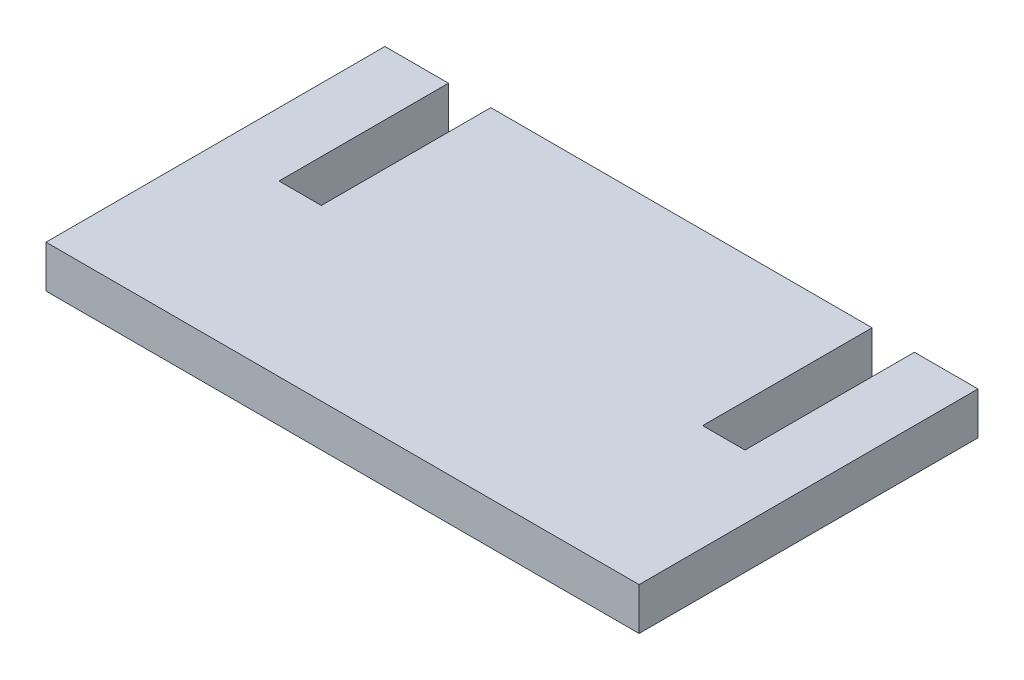
ISO-10303-21;
HEADER;
FILE_DESCRIPTION(('STEP AP214'),'2;1');
FILE_NAME('part.step','',(''),(''),'','','');
FILE_SCHEMA(('AUTOMOTIVE_DESIGN { 1 0 10303 214 1 1 1 1 }'));
ENDSEC;
DATA;
#1=APPLICATION_CONTEXT('core data for automotive mechanical design processes');
#2=APPLICATION_PROTOCOL_DEFINITION('international standard','automotive_design',2000,#1);
#3=PRODUCT_CONTEXT('',#1,'mechanical');
#4=PRODUCT('Part','Part','',(#3));
#5=PRODUCT_RELATED_PRODUCT_CATEGORY('part','',(#4));
#6=PRODUCT_DEFINITION_FORMATION('','',#4);
#7=PRODUCT_DEFINITION_CONTEXT('part definition',#1,'design');
#8=PRODUCT_DEFINITION('design','',#6,#7);
#9=PRODUCT_DEFINITION_SHAPE('','',#8);
#10=(LENGTH_UNIT() NAMED_UNIT(*) SI_UNIT(.MILLI.,.METRE.));
#11=(NAMED_UNIT(*) PLANE_ANGLE_UNIT() SI_UNIT($,.RADIAN.));
#12=(NAMED_UNIT(*) SI_UNIT($,.STERADIAN.) SOLID_ANGLE_UNIT());
#13=UNCERTAINTY_MEASURE_WITH_UNIT(LENGTH_MEASURE(1.E-05),#10,'distance_accuracy_value','');
#14=(GEOMETRIC_REPRESENTATION_CONTEXT(3) GLOBAL_UNCERTAINTY_ASSIGNED_CONTEXT((#13)) GLOBAL_UNIT_ASSIGNED_CONTEXT((#10,
#11,#12)) REPRESENTATION_CONTEXT('',''));
#15=CARTESIAN_POINT('',(0.,0.,0.));
#16=DIRECTION('',(0.,0.,1.));
#17=DIRECTION('',(1.,0.,0.));
#18=AXIS2_PLACEMENT_3D('',#15,#16,#17);
#19=CARTESIAN_POINT('',(0.,2.54,0.));
#20=DIRECTION('',(0.,0.,1.));
#21=DIRECTION('',(1.,0.,0.));
#22=AXIS2_PLACEMENT_3D('',#19,#20,#21);
#23=PLANE('',#22);
#24=DIRECTION('',(-1.,0.,0.));
#25=VECTOR('',#24,1.);
#26=CARTESIAN_POINT('',(0.,2.54,0.));
#27=LINE('',#26,#25);
#28=CARTESIAN_POINT('',(29.21,2.54,0.));
#29=VERTEX_POINT('',#28);
#30=CARTESIAN_POINT('',(6.35,2.54,0.));
#31=VERTEX_POINT('',#30);
#32=EDGE_CURVE('E196',#29,#31,#27,.T.);
#33=ORIENTED_EDGE('',*,*,#32,.F.);
#34=DIRECTION('',(0.,1.,0.));
#35=VECTOR('',#34,1.);
#36=CARTESIAN_POINT('',(29.21,0.,0.));
#37=LINE('',#36,#35);
#38=CARTESIAN_POINT('',(29.21,0.,0.));
#39=VERTEX_POINT('',#38);
#40=EDGE_CURVE('E151',#39,#29,#37,.T.);
#41=ORIENTED_EDGE('',*,*,#40,.F.);
#42=DIRECTION('',(-1.,0.,0.));
#43=VECTOR('',#42,1.);
#44=CARTESIAN_POINT('',(0.,0.,0.));
#45=LINE('',#44,#43);
#46=CARTESIAN_POINT('',(6.35,0.,0.));
#47=VERTEX_POINT('',#46);
#48=EDGE_CURVE('E142',#39,#47,#45,.T.);
#49=ORIENTED_EDGE('',*,*,#48,.T.);
#50=DIRECTION('',(0.,1.,0.));
#51=VECTOR('',#50,1.);
#52=CARTESIAN_POINT('',(6.35,0.,0.));
#53=LINE('',#52,#51);
#54=EDGE_CURVE('E177',#47,#31,#53,.T.);
#55=ORIENTED_EDGE('',*,*,#54,.T.);
#56=EDGE_LOOP('',(#33,#41,#49,#55));
#57=FACE_BOUND('',#56,.T.);
#58=ADVANCED_FACE('F33',(#57),#23,.F.);
#59=CARTESIAN_POINT('',(3.81,2.54,0.));
#60=VERTEX_POINT('',#59);
#61=CARTESIAN_POINT('',(0.,2.54,0.));
#62=VERTEX_POINT('',#61);
#63=EDGE_CURVE('E191',#60,#62,#27,.T.);
#64=ORIENTED_EDGE('',*,*,#63,.F.);
#65=DIRECTION('',(0.,1.,0.));
#66=VECTOR('',#65,1.);
#67=CARTESIAN_POINT('',(3.81,0.,0.));
#68=LINE('',#67,#66);
#69=CARTESIAN_POINT('',(3.81,0.,0.));
#70=VERTEX_POINT('',#69);
#71=EDGE_CURVE('E174',#70,#60,#68,.T.);
#72=ORIENTED_EDGE('',*,*,#71,.F.);
#73=CARTESIAN_POINT('',(0.,0.,0.));
#74=VERTEX_POINT('',#73);
#75=EDGE_CURVE('E203',#70,#74,#45,.T.);
#76=ORIENTED_EDGE('',*,*,#75,.T.);
#77=DIRECTION('',(0.,-1.,0.));
#78=VECTOR('',#77,1.);
#79=CARTESIAN_POINT('',(0.,2.54,0.));
#80=LINE('',#79,#78);
#81=EDGE_CURVE('E195',#62,#74,#80,.T.);
#82=ORIENTED_EDGE('',*,*,#81,.F.);
#83=EDGE_LOOP('',(#64,#72,#76,#82));
#84=FACE_BOUND('',#83,.T.);
#85=ADVANCED_FACE('F244',(#84),#23,.F.);
#86=CARTESIAN_POINT('',(0.,2.54,0.));
#87=DIRECTION('',(1.,0.,0.));
#88=DIRECTION('',(0.,0.,-1.));
#89=AXIS2_PLACEMENT_3D('',#86,#87,#88);
#90=PLANE('',#89);
#91=DIRECTION('',(0.,0.,1.));
#92=VECTOR('',#91,1.);
#93=CARTESIAN_POINT('',(0.,0.,0.));
#94=LINE('',#93,#92);
#95=CARTESIAN_POINT('',(0.,0.,20.32));
#96=VERTEX_POINT('',#95);
#97=EDGE_CURVE('E176',#74,#96,#94,.T.);
#98=ORIENTED_EDGE('',*,*,#97,.T.);
#99=DIRECTION('',(0.,-1.,0.));
#100=VECTOR('',#99,1.);
#101=CARTESIAN_POINT('',(0.,2.54,20.32));
#102=LINE('',#101,#100);
#103=CARTESIAN_POINT('',(0.,2.54,20.32));
#104=VERTEX_POINT('',#103);
#105=EDGE_CURVE('E11',#104,#96,#102,.T.);
#106=ORIENTED_EDGE('',*,*,#105,.F.);
#107=DIRECTION('',(0.,0.,1.));
#108=VECTOR('',#107,1.);
#109=CARTESIAN_POINT('',(0.,2.54,0.));
#110=LINE('',#109,#108);
#111=EDGE_CURVE('E183',#62,#104,#110,.T.);
#112=ORIENTED_EDGE('',*,*,#111,.F.);
#113=ORIENTED_EDGE('',*,*,#81,.T.);
#114=EDGE_LOOP('',(#98,#106,#112,#113));
#115=FACE_BOUND('',#114,.T.);
#116=ADVANCED_FACE('F35',(#115),#90,.F.);
#117=CARTESIAN_POINT('',(0.,2.54,20.32));
#118=DIRECTION('',(0.,0.,-1.));
#119=DIRECTION('',(-1.,0.,0.));
#120=AXIS2_PLACEMENT_3D('',#117,#118,#119);
#121=PLANE('',#120);
#122=DIRECTION('',(1.,0.,0.));
#123=VECTOR('',#122,1.);
#124=CARTESIAN_POINT('',(0.,0.,20.32));
#125=LINE('',#124,#123);
#126=CARTESIAN_POINT('',(35.56,0.,20.32));
#127=VERTEX_POINT('',#126);
#128=EDGE_CURVE('E199',#96,#127,#125,.T.);
#129=ORIENTED_EDGE('',*,*,#128,.T.);
#130=DIRECTION('',(0.,-1.,0.));
#131=VECTOR('',#130,1.);
#132=CARTESIAN_POINT('',(35.56,2.54,20.32));
#133=LINE('',#132,#131);
#134=CARTESIAN_POINT('',(35.56,2.54,20.32));
#135=VERTEX_POINT('',#134);
#136=EDGE_CURVE('E41',#135,#127,#133,.T.);
#137=ORIENTED_EDGE('',*,*,#136,.F.);
#138=DIRECTION('',(1.,0.,0.));
#139=VECTOR('',#138,1.);
#140=CARTESIAN_POINT('',(0.,2.54,20.32));
#141=LINE('',#140,#139);
#142=EDGE_CURVE('E186',#104,#135,#141,.T.);
#143=ORIENTED_EDGE('',*,*,#142,.F.);
#144=ORIENTED_EDGE('',*,*,#105,.T.);
#145=EDGE_LOOP('',(#129,#137,#143,#144));
#146=FACE_BOUND('',#145,.T.);
#147=ADVANCED_FACE('F228',(#146),#121,.F.);
#148=CARTESIAN_POINT('',(35.56,2.54,0.));
#149=DIRECTION('',(-1.,0.,0.));
#150=DIRECTION('',(0.,0.,1.));
#151=AXIS2_PLACEMENT_3D('',#148,#149,#150);
#152=PLANE('',#151);
#153=DIRECTION('',(0.,0.,-1.));
#154=VECTOR('',#153,1.);
#155=CARTESIAN_POINT('',(35.56,0.,0.));
#156=LINE('',#155,#154);
#157=CARTESIAN_POINT('',(35.56,0.,0.));
#158=VERTEX_POINT('',#157);
#159=EDGE_CURVE('E201',#127,#158,#156,.T.);
#160=ORIENTED_EDGE('',*,*,#159,.T.);
#161=DIRECTION('',(0.,-1.,0.));
#162=VECTOR('',#161,1.);
#163=CARTESIAN_POINT('',(35.56,2.54,0.));
#164=LINE('',#163,#162);
#165=CARTESIAN_POINT('',(35.56,2.54,0.));
#166=VERTEX_POINT('',#165);
#167=EDGE_CURVE('E208',#166,#158,#164,.T.);
#168=ORIENTED_EDGE('',*,*,#167,.F.);
#169=DIRECTION('',(0.,0.,-1.));
#170=VECTOR('',#169,1.);
#171=CARTESIAN_POINT('',(35.56,2.54,0.));
#172=LINE('',#171,#170);
#173=EDGE_CURVE('E189',#135,#166,#172,.T.);
#174=ORIENTED_EDGE('',*,*,#173,.F.);
#175=ORIENTED_EDGE('',*,*,#136,.T.);
#176=EDGE_LOOP('',(#160,#168,#174,#175));
#177=FACE_BOUND('',#176,.T.);
#178=ADVANCED_FACE('F215',(#177),#152,.F.);
#179=CARTESIAN_POINT('',(31.75,0.,0.));
#180=VERTEX_POINT('',#179);
#181=EDGE_CURVE('E187',#158,#180,#45,.T.);
#182=ORIENTED_EDGE('',*,*,#181,.T.);
#183=DIRECTION('',(0.,1.,0.));
#184=VECTOR('',#183,1.);
#185=CARTESIAN_POINT('',(31.75,0.,0.));
#186=LINE('',#185,#184);
#187=CARTESIAN_POINT('',(31.75,2.54,0.));
#188=VERTEX_POINT('',#187);
#189=EDGE_CURVE('E154',#180,#188,#186,.T.);
#190=ORIENTED_EDGE('',*,*,#189,.T.);
#191=EDGE_CURVE('E192',#166,#188,#27,.T.);
#192=ORIENTED_EDGE('',*,*,#191,.F.);
#193=ORIENTED_EDGE('',*,*,#167,.T.);
#194=EDGE_LOOP('',(#182,#190,#192,#193));
#195=FACE_BOUND('',#194,.T.);
#196=ADVANCED_FACE('F221',(#195),#23,.F.);
#197=CARTESIAN_POINT('',(0.,2.54,0.));
#198=DIRECTION('',(0.,1.,0.));
#199=DIRECTION('',(0.,0.,1.));
#200=AXIS2_PLACEMENT_3D('',#197,#198,#199);
#201=PLANE('',#200);
#202=DIRECTION('',(0.,0.,1.));
#203=VECTOR('',#202,1.);
#204=CARTESIAN_POINT('',(29.21,2.54,0.));
#205=LINE('',#204,#203);
#206=CARTESIAN_POINT('',(29.21,2.54,10.16));
#207=VERTEX_POINT('',#206);
#208=EDGE_CURVE('E129',#29,#207,#205,.T.);
#209=ORIENTED_EDGE('',*,*,#208,.F.);
#210=ORIENTED_EDGE('',*,*,#32,.T.);
#211=DIRECTION('',(0.,0.,-1.));
#212=VECTOR('',#211,1.);
#213=CARTESIAN_POINT('',(6.35,2.54,0.));
#214=LINE('',#213,#212);
#215=CARTESIAN_POINT('',(6.35,2.54,10.16));
#216=VERTEX_POINT('',#215);
#217=EDGE_CURVE('E162',#216,#31,#214,.T.);
#218=ORIENTED_EDGE('',*,*,#217,.F.);
#219=DIRECTION('',(1.,0.,0.));
#220=VECTOR('',#219,1.);
#221=CARTESIAN_POINT('',(3.81,2.54,10.16));
#222=LINE('',#221,#220);
#223=CARTESIAN_POINT('',(3.81,2.54,10.16));
#224=VERTEX_POINT('',#223);
#225=EDGE_CURVE('E169',#224,#216,#222,.T.);
#226=ORIENTED_EDGE('',*,*,#225,.F.);
#227=DIRECTION('',(0.,0.,1.));
#228=VECTOR('',#227,1.);
#229=CARTESIAN_POINT('',(3.81,2.54,0.));
#230=LINE('',#229,#228);
#231=EDGE_CURVE('E153',#60,#224,#230,.T.);
#232=ORIENTED_EDGE('',*,*,#231,.F.);
#233=ORIENTED_EDGE('',*,*,#63,.T.);
#234=ORIENTED_EDGE('',*,*,#111,.T.);
#235=ORIENTED_EDGE('',*,*,#142,.T.);
#236=ORIENTED_EDGE('',*,*,#173,.T.);
#237=ORIENTED_EDGE('',*,*,#191,.T.);
#238=DIRECTION('',(0.,0.,-1.));
#239=VECTOR('',#238,1.);
#240=CARTESIAN_POINT('',(31.75,2.54,0.));
#241=LINE('',#240,#239);
#242=CARTESIAN_POINT('',(31.75,2.54,10.16));
#243=VERTEX_POINT('',#242);
#244=EDGE_CURVE('E143',#243,#188,#241,.T.);
#245=ORIENTED_EDGE('',*,*,#244,.F.);
#246=DIRECTION('',(1.,0.,0.));
#247=VECTOR('',#246,1.);
#248=CARTESIAN_POINT('',(29.21,2.54,10.16));
#249=LINE('',#248,#247);
#250=EDGE_CURVE('E145',#207,#243,#249,.T.);
#251=ORIENTED_EDGE('',*,*,#250,.F.);
#252=EDGE_LOOP('',(#209,#210,#218,#226,#232,#233,#234,#235,#236,#237,#245,#251));
#253=FACE_BOUND('',#252,.T.);
#254=ADVANCED_FACE('F225',(#253),#201,.T.);
#255=CARTESIAN_POINT('',(0.,0.,0.));
#256=DIRECTION('',(0.,1.,0.));
#257=DIRECTION('',(0.,0.,1.));
#258=AXIS2_PLACEMENT_3D('',#255,#256,#257);
#259=PLANE('',#258);
#260=ORIENTED_EDGE('',*,*,#48,.F.);
#261=DIRECTION('',(0.,0.,1.));
#262=VECTOR('',#261,1.);
#263=CARTESIAN_POINT('',(29.21,0.,0.));
#264=LINE('',#263,#262);
#265=CARTESIAN_POINT('',(29.21,0.,10.16));
#266=VERTEX_POINT('',#265);
#267=EDGE_CURVE('E126',#39,#266,#264,.T.);
#268=ORIENTED_EDGE('',*,*,#267,.T.);
#269=DIRECTION('',(1.,0.,0.));
#270=VECTOR('',#269,1.);
#271=CARTESIAN_POINT('',(29.21,0.,10.16));
#272=LINE('',#271,#270);
#273=CARTESIAN_POINT('',(31.75,0.,10.16));
#274=VERTEX_POINT('',#273);
#275=EDGE_CURVE('E136',#266,#274,#272,.T.);
#276=ORIENTED_EDGE('',*,*,#275,.T.);
#277=DIRECTION('',(0.,0.,-1.));
#278=VECTOR('',#277,1.);
#279=CARTESIAN_POINT('',(31.75,0.,0.));
#280=LINE('',#279,#278);
#281=EDGE_CURVE('E48',#274,#180,#280,.T.);
#282=ORIENTED_EDGE('',*,*,#281,.T.);
#283=ORIENTED_EDGE('',*,*,#181,.F.);
#284=ORIENTED_EDGE('',*,*,#159,.F.);
#285=ORIENTED_EDGE('',*,*,#128,.F.);
#286=ORIENTED_EDGE('',*,*,#97,.F.);
#287=ORIENTED_EDGE('',*,*,#75,.F.);
#288=DIRECTION('',(0.,0.,1.));
#289=VECTOR('',#288,1.);
#290=CARTESIAN_POINT('',(3.81,0.,0.));
#291=LINE('',#290,#289);
#292=CARTESIAN_POINT('',(3.81,0.,10.16));
#293=VERTEX_POINT('',#292);
#294=EDGE_CURVE('E158',#70,#293,#291,.T.);
#295=ORIENTED_EDGE('',*,*,#294,.T.);
#296=DIRECTION('',(1.,0.,0.));
#297=VECTOR('',#296,1.);
#298=CARTESIAN_POINT('',(3.81,0.,10.16));
#299=LINE('',#298,#297);
#300=CARTESIAN_POINT('',(6.35,0.,10.16));
#301=VERTEX_POINT('',#300);
#302=EDGE_CURVE('E161',#293,#301,#299,.T.);
#303=ORIENTED_EDGE('',*,*,#302,.T.);
#304=DIRECTION('',(0.,0.,-1.));
#305=VECTOR('',#304,1.);
#306=CARTESIAN_POINT('',(6.35,0.,0.));
#307=LINE('',#306,#305);
#308=EDGE_CURVE('E56',#301,#47,#307,.T.);
#309=ORIENTED_EDGE('',*,*,#308,.T.);
#310=EDGE_LOOP('',(#260,#268,#276,#282,#283,#284,#285,#286,#287,#295,#303,#309));
#311=FACE_BOUND('',#310,.T.);
#312=ADVANCED_FACE('F141',(#311),#259,.F.);
#313=CARTESIAN_POINT('',(3.81,0.,0.));
#314=DIRECTION('',(-1.,0.,0.));
#315=DIRECTION('',(0.,0.,1.));
#316=AXIS2_PLACEMENT_3D('',#313,#314,#315);
#317=PLANE('',#316);
#318=ORIENTED_EDGE('',*,*,#231,.T.);
#319=DIRECTION('',(0.,1.,0.));
#320=VECTOR('',#319,1.);
#321=CARTESIAN_POINT('',(3.81,0.,10.16));
#322=LINE('',#321,#320);
#323=EDGE_CURVE('E166',#293,#224,#322,.T.);
#324=ORIENTED_EDGE('',*,*,#323,.F.);
#325=ORIENTED_EDGE('',*,*,#294,.F.);
#326=ORIENTED_EDGE('',*,*,#71,.T.);
#327=EDGE_LOOP('',(#318,#324,#325,#326));
#328=FACE_BOUND('',#327,.T.);
#329=ADVANCED_FACE('F292',(#328),#317,.F.);
#330=CARTESIAN_POINT('',(6.35,0.,0.));
#331=DIRECTION('',(1.,0.,0.));
#332=DIRECTION('',(0.,0.,-1.));
#333=AXIS2_PLACEMENT_3D('',#330,#331,#332);
#334=PLANE('',#333);
#335=ORIENTED_EDGE('',*,*,#217,.T.);
#336=ORIENTED_EDGE('',*,*,#54,.F.);
#337=ORIENTED_EDGE('',*,*,#308,.F.);
#338=DIRECTION('',(0.,1.,0.));
#339=VECTOR('',#338,1.);
#340=CARTESIAN_POINT('',(6.35,0.,10.16));
#341=LINE('',#340,#339);
#342=EDGE_CURVE('E180',#301,#216,#341,.T.);
#343=ORIENTED_EDGE('',*,*,#342,.T.);
#344=EDGE_LOOP('',(#335,#336,#337,#343));
#345=FACE_BOUND('',#344,.T.);
#346=ADVANCED_FACE('F236',(#345),#334,.F.);
#347=CARTESIAN_POINT('',(3.81,0.,10.16));
#348=DIRECTION('',(0.,0.,1.));
#349=DIRECTION('',(1.,0.,0.));
#350=AXIS2_PLACEMENT_3D('',#347,#348,#349);
#351=PLANE('',#350);
#352=ORIENTED_EDGE('',*,*,#225,.T.);
#353=ORIENTED_EDGE('',*,*,#342,.F.);
#354=ORIENTED_EDGE('',*,*,#302,.F.);
#355=ORIENTED_EDGE('',*,*,#323,.T.);
#356=EDGE_LOOP('',(#352,#353,#354,#355));
#357=FACE_BOUND('',#356,.T.);
#358=ADVANCED_FACE('F240',(#357),#351,.F.);
#359=CARTESIAN_POINT('',(29.21,0.,0.));
#360=DIRECTION('',(-1.,0.,0.));
#361=DIRECTION('',(0.,0.,1.));
#362=AXIS2_PLACEMENT_3D('',#359,#360,#361);
#363=PLANE('',#362);
#364=ORIENTED_EDGE('',*,*,#208,.T.);
#365=DIRECTION('',(0.,1.,0.));
#366=VECTOR('',#365,1.);
#367=CARTESIAN_POINT('',(29.21,0.,10.16));
#368=LINE('',#367,#366);
#369=EDGE_CURVE('E122',#266,#207,#368,.T.);
#370=ORIENTED_EDGE('',*,*,#369,.F.);
#371=ORIENTED_EDGE('',*,*,#267,.F.);
#372=ORIENTED_EDGE('',*,*,#40,.T.);
#373=EDGE_LOOP('',(#364,#370,#371,#372));
#374=FACE_BOUND('',#373,.T.);
#375=ADVANCED_FACE('F124',(#374),#363,.F.);
#376=CARTESIAN_POINT('',(31.75,0.,0.));
#377=DIRECTION('',(1.,0.,0.));
#378=DIRECTION('',(0.,0.,-1.));
#379=AXIS2_PLACEMENT_3D('',#376,#377,#378);
#380=PLANE('',#379);
#381=ORIENTED_EDGE('',*,*,#244,.T.);
#382=ORIENTED_EDGE('',*,*,#189,.F.);
#383=ORIENTED_EDGE('',*,*,#281,.F.);
#384=DIRECTION('',(0.,1.,0.));
#385=VECTOR('',#384,1.);
#386=CARTESIAN_POINT('',(31.75,0.,10.16));
#387=LINE('',#386,#385);
#388=EDGE_CURVE('E133',#274,#243,#387,.T.);
#389=ORIENTED_EDGE('',*,*,#388,.T.);
#390=EDGE_LOOP('',(#381,#382,#383,#389));
#391=FACE_BOUND('',#390,.T.);
#392=ADVANCED_FACE('F332',(#391),#380,.F.);
#393=CARTESIAN_POINT('',(29.21,0.,10.16));
#394=DIRECTION('',(0.,0.,1.));
#395=DIRECTION('',(1.,0.,0.));
#396=AXIS2_PLACEMENT_3D('',#393,#394,#395);
#397=PLANE('',#396);
#398=ORIENTED_EDGE('',*,*,#250,.T.);
#399=ORIENTED_EDGE('',*,*,#388,.F.);
#400=ORIENTED_EDGE('',*,*,#275,.F.);
#401=ORIENTED_EDGE('',*,*,#369,.T.);
#402=EDGE_LOOP('',(#398,#399,#400,#401));
#403=FACE_BOUND('',#402,.T.);
#404=ADVANCED_FACE('F137',(#403),#397,.F.);
#405=CLOSED_SHELL('',(#58,#85,#116,#147,#178,#196,#254,#312,#329,#346,#358,#375,#392,#404));
#406=MANIFOLD_SOLID_BREP('B2',#405);
#407=ADVANCED_BREP_SHAPE_REPRESENTATION('',(#18,#406),#14);
#408=SHAPE_DEFINITION_REPRESENTATION(#9,#407);
ENDSEC;
END-ISO-10303-21;
